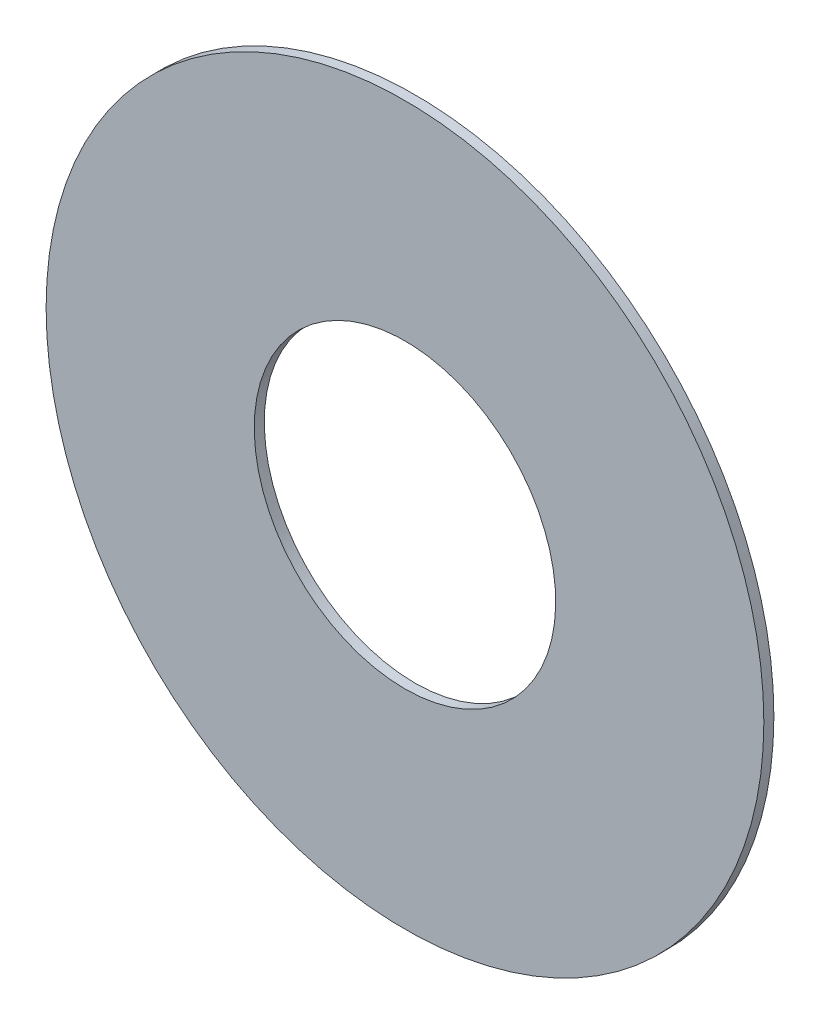
ISO-10303-21;
HEADER;
FILE_DESCRIPTION(('STEP AP214'),'2;1');
FILE_NAME('part.step','',(''),(''),'','','');
FILE_SCHEMA(('AUTOMOTIVE_DESIGN { 1 0 10303 214 1 1 1 1 }'));
ENDSEC;
DATA;
#1=APPLICATION_CONTEXT('core data for automotive mechanical design processes');
#2=APPLICATION_PROTOCOL_DEFINITION('international standard','automotive_design',2000,#1);
#3=PRODUCT_CONTEXT('',#1,'mechanical');
#4=PRODUCT('Part','Part','',(#3));
#5=PRODUCT_RELATED_PRODUCT_CATEGORY('part','',(#4));
#6=PRODUCT_DEFINITION_FORMATION('','',#4);
#7=PRODUCT_DEFINITION_CONTEXT('part definition',#1,'design');
#8=PRODUCT_DEFINITION('design','',#6,#7);
#9=PRODUCT_DEFINITION_SHAPE('','',#8);
#10=(LENGTH_UNIT() NAMED_UNIT(*) SI_UNIT(.MILLI.,.METRE.));
#11=(NAMED_UNIT(*) PLANE_ANGLE_UNIT() SI_UNIT($,.RADIAN.));
#12=(NAMED_UNIT(*) SI_UNIT($,.STERADIAN.) SOLID_ANGLE_UNIT());
#13=UNCERTAINTY_MEASURE_WITH_UNIT(LENGTH_MEASURE(1.E-05),#10,'distance_accuracy_value','');
#14=(GEOMETRIC_REPRESENTATION_CONTEXT(3) GLOBAL_UNCERTAINTY_ASSIGNED_CONTEXT((#13)) GLOBAL_UNIT_ASSIGNED_CONTEXT((#10,
#11,#12)) REPRESENTATION_CONTEXT('',''));
#15=CARTESIAN_POINT('',(0.,0.,0.));
#16=DIRECTION('',(0.,0.,1.));
#17=DIRECTION('',(1.,0.,0.));
#18=AXIS2_PLACEMENT_3D('',#15,#16,#17);
#19=CARTESIAN_POINT('',(158.952,-126.034,-0.045));
#20=DIRECTION('',(0.,0.,-1.));
#21=DIRECTION('',(0.,-1.,0.));
#22=AXIS2_PLACEMENT_3D('',#19,#20,#21);
#23=CYLINDRICAL_SURFACE('',#22,0.525);
#24=CARTESIAN_POINT('',(158.952,-126.034,1.67));
#25=DIRECTION('',(0.,0.,-1.));
#26=DIRECTION('',(0.,-1.,0.));
#27=AXIS2_PLACEMENT_3D('',#24,#25,#26);
#28=CIRCLE('',#27,0.525);
#29=CARTESIAN_POINT('',(158.952,-126.559,1.67));
#30=VERTEX_POINT('',#29);
#31=EDGE_CURVE('E26',#30,#30,#28,.T.);
#32=ORIENTED_EDGE('',*,*,#31,.T.);
#33=DIRECTION('',(0.,0.,1.));
#34=VECTOR('',#33,1.);
#35=CARTESIAN_POINT('',(158.952,-126.559,-0.045));
#36=LINE('',#35,#34);
#37=CARTESIAN_POINT('',(158.952,-126.559,1.705));
#38=VERTEX_POINT('',#37);
#39=EDGE_CURVE('E11',#30,#38,#36,.T.);
#40=ORIENTED_EDGE('',*,*,#39,.T.);
#41=CARTESIAN_POINT('',(158.952,-126.034,1.705));
#42=DIRECTION('',(0.,0.,-1.));
#43=DIRECTION('',(0.,-1.,0.));
#44=AXIS2_PLACEMENT_3D('',#41,#42,#43);
#45=CIRCLE('',#44,0.525);
#46=EDGE_CURVE('E70',#38,#38,#45,.T.);
#47=ORIENTED_EDGE('',*,*,#46,.F.);
#48=ORIENTED_EDGE('',*,*,#39,.F.);
#49=EDGE_LOOP('',(#32,#40,#47,#48));
#50=FACE_BOUND('',#49,.T.);
#51=ADVANCED_FACE('F17',(#50),#23,.F.);
#52=CARTESIAN_POINT('',(158.952,-126.034,1.67));
#53=DIRECTION('',(0.,0.,1.));
#54=DIRECTION('',(1.,0.,0.));
#55=AXIS2_PLACEMENT_3D('',#52,#53,#54);
#56=PLANE('',#55);
#57=ORIENTED_EDGE('',*,*,#31,.F.);
#58=EDGE_LOOP('',(#57));
#59=FACE_BOUND('',#58,.T.);
#60=CARTESIAN_POINT('',(158.952,-126.034,1.67));
#61=DIRECTION('',(0.,0.,1.));
#62=DIRECTION('',(1.,0.,0.));
#63=AXIS2_PLACEMENT_3D('',#60,#61,#62);
#64=CIRCLE('',#63,1.25);
#65=CARTESIAN_POINT('',(160.202,-126.034,1.67));
#66=VERTEX_POINT('',#65);
#67=EDGE_CURVE('E57',#66,#66,#64,.T.);
#68=ORIENTED_EDGE('',*,*,#67,.F.);
#69=EDGE_LOOP('',(#68));
#70=FACE_BOUND('',#69,.T.);
#71=ADVANCED_FACE('F19',(#59,#70),#56,.F.);
#72=CARTESIAN_POINT('',(158.952,-126.034,1.705));
#73=DIRECTION('',(0.,0.,1.));
#74=DIRECTION('',(1.,0.,0.));
#75=AXIS2_PLACEMENT_3D('',#72,#73,#74);
#76=PLANE('',#75);
#77=ORIENTED_EDGE('',*,*,#46,.T.);
#78=EDGE_LOOP('',(#77));
#79=FACE_BOUND('',#78,.T.);
#80=CARTESIAN_POINT('',(158.952,-126.034,1.705));
#81=DIRECTION('',(0.,0.,1.));
#82=DIRECTION('',(1.,0.,0.));
#83=AXIS2_PLACEMENT_3D('',#80,#81,#82);
#84=CIRCLE('',#83,1.25);
#85=CARTESIAN_POINT('',(160.202,-126.034,1.705));
#86=VERTEX_POINT('',#85);
#87=EDGE_CURVE('E55',#86,#86,#84,.T.);
#88=ORIENTED_EDGE('',*,*,#87,.T.);
#89=EDGE_LOOP('',(#88));
#90=FACE_BOUND('',#89,.T.);
#91=ADVANCED_FACE('F61',(#79,#90),#76,.T.);
#92=CARTESIAN_POINT('',(158.952,-126.034,1.67));
#93=DIRECTION('',(0.,0.,1.));
#94=DIRECTION('',(1.,0.,0.));
#95=AXIS2_PLACEMENT_3D('',#92,#93,#94);
#96=CYLINDRICAL_SURFACE('',#95,1.25);
#97=ORIENTED_EDGE('',*,*,#87,.F.);
#98=DIRECTION('',(0.,0.,1.));
#99=VECTOR('',#98,1.);
#100=CARTESIAN_POINT('',(160.202,-126.034,1.67));
#101=LINE('',#100,#99);
#102=EDGE_CURVE('E52',#66,#86,#101,.T.);
#103=ORIENTED_EDGE('',*,*,#102,.F.);
#104=ORIENTED_EDGE('',*,*,#67,.T.);
#105=ORIENTED_EDGE('',*,*,#102,.T.);
#106=EDGE_LOOP('',(#97,#103,#104,#105));
#107=FACE_BOUND('',#106,.T.);
#108=ADVANCED_FACE('F54',(#107),#96,.T.);
#109=CLOSED_SHELL('',(#51,#71,#91,#108));
#110=MANIFOLD_SOLID_BREP('B1',#109);
#111=ADVANCED_BREP_SHAPE_REPRESENTATION('',(#18,#110),#14);
#112=SHAPE_DEFINITION_REPRESENTATION(#9,#111);
ENDSEC;
END-ISO-10303-21;
